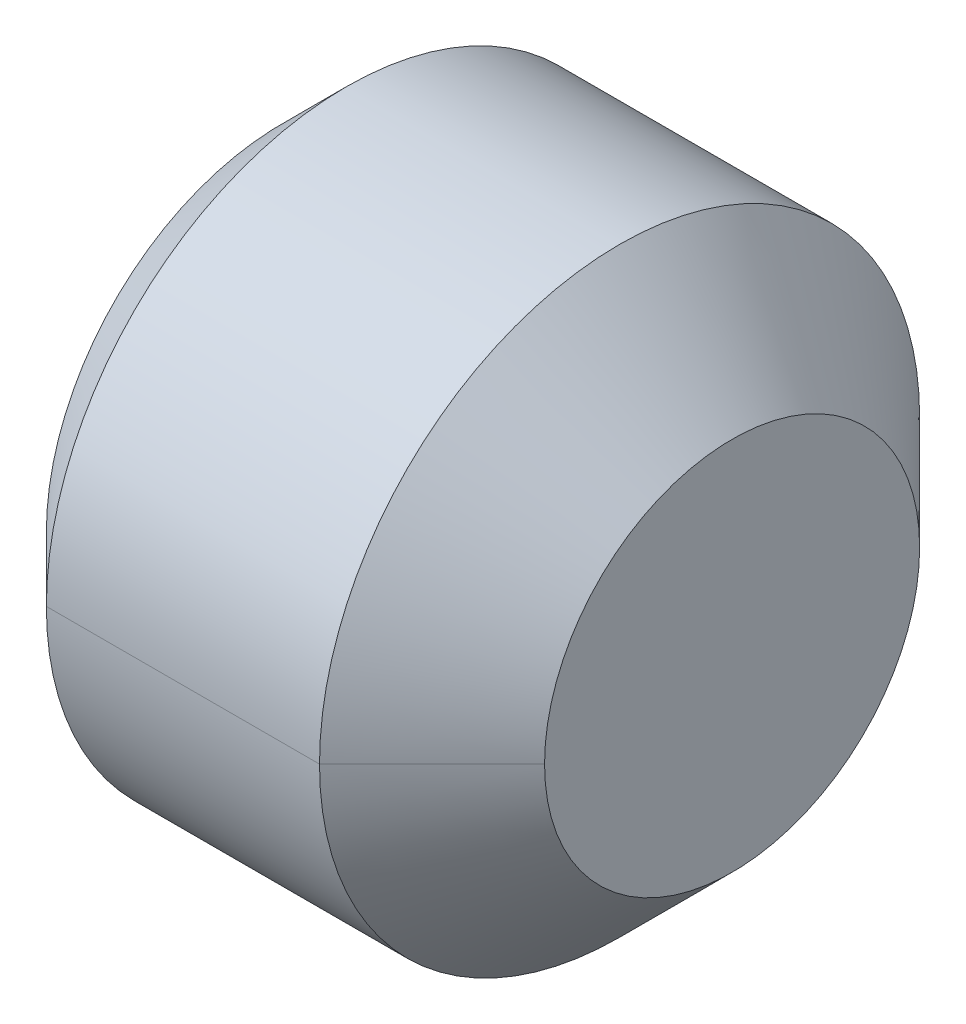
ISO-10303-21;
HEADER;
FILE_DESCRIPTION(('STEP AP214'),'2;1');
FILE_NAME('part.step','',(''),(''),'','','');
FILE_SCHEMA(('AUTOMOTIVE_DESIGN { 1 0 10303 214 1 1 1 1 }'));
ENDSEC;
DATA;
#1=APPLICATION_CONTEXT('core data for automotive mechanical design processes');
#2=APPLICATION_PROTOCOL_DEFINITION('international standard','automotive_design',2000,#1);
#3=PRODUCT_CONTEXT('',#1,'mechanical');
#4=PRODUCT('Part','Part','',(#3));
#5=PRODUCT_RELATED_PRODUCT_CATEGORY('part','',(#4));
#6=PRODUCT_DEFINITION_FORMATION('','',#4);
#7=PRODUCT_DEFINITION_CONTEXT('part definition',#1,'design');
#8=PRODUCT_DEFINITION('design','',#6,#7);
#9=PRODUCT_DEFINITION_SHAPE('','',#8);
#10=(LENGTH_UNIT() NAMED_UNIT(*) SI_UNIT(.MILLI.,.METRE.));
#11=(NAMED_UNIT(*) PLANE_ANGLE_UNIT() SI_UNIT($,.RADIAN.));
#12=(NAMED_UNIT(*) SI_UNIT($,.STERADIAN.) SOLID_ANGLE_UNIT());
#13=UNCERTAINTY_MEASURE_WITH_UNIT(LENGTH_MEASURE(1.E-05),#10,'distance_accuracy_value','');
#14=(GEOMETRIC_REPRESENTATION_CONTEXT(3) GLOBAL_UNCERTAINTY_ASSIGNED_CONTEXT((#13)) GLOBAL_UNIT_ASSIGNED_CONTEXT((#10,
#11,#12)) REPRESENTATION_CONTEXT('',''));
#15=CARTESIAN_POINT('',(0.,0.,0.));
#16=DIRECTION('',(0.,0.,1.));
#17=DIRECTION('',(1.,0.,0.));
#18=AXIS2_PLACEMENT_3D('',#15,#16,#17);
#19=CARTESIAN_POINT('',(-1.5,0.,0.));
#20=DIRECTION('',(-1.,0.,0.));
#21=DIRECTION('',(0.,0.,1.));
#22=AXIS2_PLACEMENT_3D('',#19,#20,#21);
#23=PLANE('',#22);
#24=DIRECTION('',(0.,0.866025403784422,0.500000000000029));
#25=VECTOR('',#24,1.);
#26=CARTESIAN_POINT('',(-1.5,-1.,0.57735026918963));
#27=LINE('',#26,#25);
#28=CARTESIAN_POINT('',(-1.5,-1.,0.57735026918963));
#29=VERTEX_POINT('',#28);
#30=CARTESIAN_POINT('',(-1.5,-0.50000000000004,0.866025403784442));
#31=VERTEX_POINT('',#30);
#32=EDGE_CURVE('E11',#29,#31,#27,.T.);
#33=ORIENTED_EDGE('',*,*,#32,.T.);
#34=CARTESIAN_POINT('',(-1.5,0.,0.));
#35=DIRECTION('',(1.,0.,0.));
#36=DIRECTION('',(0.,0.,1.));
#37=AXIS2_PLACEMENT_3D('',#34,#35,#36);
#38=CIRCLE('',#37,1.);
#39=CARTESIAN_POINT('',(-1.5,-1.,0.));
#40=VERTEX_POINT('',#39);
#41=EDGE_CURVE('E24',#31,#40,#38,.T.);
#42=ORIENTED_EDGE('',*,*,#41,.T.);
#43=DIRECTION('',(0.,0.,1.));
#44=VECTOR('',#43,1.);
#45=CARTESIAN_POINT('',(-1.5,-1.,-0.57735026918963));
#46=LINE('',#45,#44);
#47=EDGE_CURVE('E333',#40,#29,#46,.T.);
#48=ORIENTED_EDGE('',*,*,#47,.T.);
#49=EDGE_LOOP('',(#33,#42,#48));
#50=FACE_BOUND('',#49,.T.);
#51=ADVANCED_FACE('F16',(#50),#23,.T.);
#52=CARTESIAN_POINT('',(-1.5,-1.,-0.57735026918963));
#53=DIRECTION('',(0.,-1.,0.));
#54=DIRECTION('',(0.,0.,-1.));
#55=AXIS2_PLACEMENT_3D('',#52,#53,#54);
#56=PLANE('',#55);
#57=DIRECTION('',(0.,0.,1.));
#58=VECTOR('',#57,1.);
#59=CARTESIAN_POINT('',(-3.,-1.,-0.57735026918963));
#60=LINE('',#59,#58);
#61=CARTESIAN_POINT('',(-3.,-1.,-0.57735026918963));
#62=VERTEX_POINT('',#61);
#63=CARTESIAN_POINT('',(-3.,-1.,0.57735026918963));
#64=VERTEX_POINT('',#63);
#65=EDGE_CURVE('E329',#62,#64,#60,.T.);
#66=ORIENTED_EDGE('',*,*,#65,.T.);
#67=DIRECTION('',(-1.,0.,0.));
#68=VECTOR('',#67,1.);
#69=CARTESIAN_POINT('',(-1.5,-1.,0.57735026918963));
#70=LINE('',#69,#68);
#71=EDGE_CURVE('E324',#29,#64,#70,.T.);
#72=ORIENTED_EDGE('',*,*,#71,.F.);
#73=ORIENTED_EDGE('',*,*,#47,.F.);
#74=DIRECTION('',(0.,0.,1.));
#75=VECTOR('',#74,1.);
#76=CARTESIAN_POINT('',(-1.5,-1.,-0.57735026918963));
#77=LINE('',#76,#75);
#78=CARTESIAN_POINT('',(-1.5,-1.,-0.57735026918963));
#79=VERTEX_POINT('',#78);
#80=EDGE_CURVE('E319',#79,#40,#77,.T.);
#81=ORIENTED_EDGE('',*,*,#80,.F.);
#82=DIRECTION('',(-1.,0.,0.));
#83=VECTOR('',#82,1.);
#84=CARTESIAN_POINT('',(-1.5,-1.,-0.57735026918963));
#85=LINE('',#84,#83);
#86=EDGE_CURVE('E315',#79,#62,#85,.T.);
#87=ORIENTED_EDGE('',*,*,#86,.T.);
#88=EDGE_LOOP('',(#66,#72,#73,#81,#87));
#89=FACE_BOUND('',#88,.T.);
#90=ADVANCED_FACE('F344',(#89),#56,.F.);
#91=CARTESIAN_POINT('',(-1.5,0.,-1.1547005383793));
#92=DIRECTION('',(0.,-0.500000000000029,-0.866025403784422));
#93=DIRECTION('',(0.,0.866025403784422,-0.500000000000029));
#94=AXIS2_PLACEMENT_3D('',#91,#92,#93);
#95=PLANE('',#94);
#96=DIRECTION('',(0.,-0.866025403784422,0.500000000000029));
#97=VECTOR('',#96,1.);
#98=CARTESIAN_POINT('',(-3.,0.,-1.1547005383793));
#99=LINE('',#98,#97);
#100=CARTESIAN_POINT('',(-3.,0.,-1.1547005383793));
#101=VERTEX_POINT('',#100);
#102=EDGE_CURVE('E310',#101,#62,#99,.T.);
#103=ORIENTED_EDGE('',*,*,#102,.T.);
#104=ORIENTED_EDGE('',*,*,#86,.F.);
#105=DIRECTION('',(0.,-0.866025403784422,0.500000000000029));
#106=VECTOR('',#105,1.);
#107=CARTESIAN_POINT('',(-1.5,0.,-1.1547005383793));
#108=LINE('',#107,#106);
#109=CARTESIAN_POINT('',(-1.5,-0.500000000000029,-0.866025403784422));
#110=VERTEX_POINT('',#109);
#111=EDGE_CURVE('E305',#110,#79,#108,.T.);
#112=ORIENTED_EDGE('',*,*,#111,.F.);
#113=DIRECTION('',(0.,-0.866025403784422,0.500000000000029));
#114=VECTOR('',#113,1.);
#115=CARTESIAN_POINT('',(-1.5,0.,-1.1547005383793));
#116=LINE('',#115,#114);
#117=CARTESIAN_POINT('',(-1.5,0.,-1.1547005383793));
#118=VERTEX_POINT('',#117);
#119=EDGE_CURVE('E300',#118,#110,#116,.T.);
#120=ORIENTED_EDGE('',*,*,#119,.F.);
#121=DIRECTION('',(-1.,0.,0.));
#122=VECTOR('',#121,1.);
#123=CARTESIAN_POINT('',(-1.5,0.,-1.1547005383793));
#124=LINE('',#123,#122);
#125=EDGE_CURVE('E296',#118,#101,#124,.T.);
#126=ORIENTED_EDGE('',*,*,#125,.T.);
#127=EDGE_LOOP('',(#103,#104,#112,#120,#126));
#128=FACE_BOUND('',#127,.T.);
#129=ADVANCED_FACE('F362',(#128),#95,.F.);
#130=CARTESIAN_POINT('',(-1.5,1.,-0.57735026918963));
#131=DIRECTION('',(0.,0.500000000000029,-0.866025403784422));
#132=DIRECTION('',(0.,0.866025403784422,0.500000000000029));
#133=AXIS2_PLACEMENT_3D('',#130,#131,#132);
#134=PLANE('',#133);
#135=DIRECTION('',(0.,-0.866025403784422,-0.500000000000029));
#136=VECTOR('',#135,1.);
#137=CARTESIAN_POINT('',(-3.,1.,-0.57735026918963));
#138=LINE('',#137,#136);
#139=CARTESIAN_POINT('',(-3.,1.,-0.57735026918963));
#140=VERTEX_POINT('',#139);
#141=EDGE_CURVE('E291',#140,#101,#138,.T.);
#142=ORIENTED_EDGE('',*,*,#141,.T.);
#143=ORIENTED_EDGE('',*,*,#125,.F.);
#144=DIRECTION('',(0.,-0.866025403784422,-0.500000000000029));
#145=VECTOR('',#144,1.);
#146=CARTESIAN_POINT('',(-1.5,1.,-0.57735026918963));
#147=LINE('',#146,#145);
#148=CARTESIAN_POINT('',(-1.5,0.500000000000029,-0.866025403784422));
#149=VERTEX_POINT('',#148);
#150=EDGE_CURVE('E286',#149,#118,#147,.T.);
#151=ORIENTED_EDGE('',*,*,#150,.F.);
#152=DIRECTION('',(0.,-0.866025403784422,-0.500000000000029));
#153=VECTOR('',#152,1.);
#154=CARTESIAN_POINT('',(-1.5,1.,-0.57735026918963));
#155=LINE('',#154,#153);
#156=CARTESIAN_POINT('',(-1.5,1.,-0.57735026918963));
#157=VERTEX_POINT('',#156);
#158=EDGE_CURVE('E281',#157,#149,#155,.T.);
#159=ORIENTED_EDGE('',*,*,#158,.F.);
#160=DIRECTION('',(-1.,0.,0.));
#161=VECTOR('',#160,1.);
#162=CARTESIAN_POINT('',(-1.5,1.,-0.57735026918963));
#163=LINE('',#162,#161);
#164=EDGE_CURVE('E277',#157,#140,#163,.T.);
#165=ORIENTED_EDGE('',*,*,#164,.T.);
#166=EDGE_LOOP('',(#142,#143,#151,#159,#165));
#167=FACE_BOUND('',#166,.T.);
#168=ADVANCED_FACE('F382',(#167),#134,.F.);
#169=CARTESIAN_POINT('',(-1.5,1.,0.57735026918963));
#170=DIRECTION('',(0.,1.,0.));
#171=DIRECTION('',(0.,0.,1.));
#172=AXIS2_PLACEMENT_3D('',#169,#170,#171);
#173=PLANE('',#172);
#174=DIRECTION('',(-1.,0.,0.));
#175=VECTOR('',#174,1.);
#176=CARTESIAN_POINT('',(-1.5,1.,0.57735026918963));
#177=LINE('',#176,#175);
#178=CARTESIAN_POINT('',(-1.5,1.,0.57735026918963));
#179=VERTEX_POINT('',#178);
#180=CARTESIAN_POINT('',(-3.,1.,0.57735026918963));
#181=VERTEX_POINT('',#180);
#182=EDGE_CURVE('E273',#179,#181,#177,.T.);
#183=ORIENTED_EDGE('',*,*,#182,.T.);
#184=DIRECTION('',(0.,0.,1.));
#185=VECTOR('',#184,1.);
#186=CARTESIAN_POINT('',(-3.,1.,0.));
#187=LINE('',#186,#185);
#188=EDGE_CURVE('E268',#140,#181,#187,.T.);
#189=ORIENTED_EDGE('',*,*,#188,.F.);
#190=ORIENTED_EDGE('',*,*,#164,.F.);
#191=DIRECTION('',(0.,0.,-1.));
#192=VECTOR('',#191,1.);
#193=CARTESIAN_POINT('',(-1.5,1.,0.57735026918963));
#194=LINE('',#193,#192);
#195=CARTESIAN_POINT('',(-1.5,1.,0.));
#196=VERTEX_POINT('',#195);
#197=EDGE_CURVE('E263',#196,#157,#194,.T.);
#198=ORIENTED_EDGE('',*,*,#197,.F.);
#199=DIRECTION('',(0.,0.,-1.));
#200=VECTOR('',#199,1.);
#201=CARTESIAN_POINT('',(-1.5,1.,0.57735026918963));
#202=LINE('',#201,#200);
#203=EDGE_CURVE('E258',#179,#196,#202,.T.);
#204=ORIENTED_EDGE('',*,*,#203,.F.);
#205=EDGE_LOOP('',(#183,#189,#190,#198,#204));
#206=FACE_BOUND('',#205,.T.);
#207=ADVANCED_FACE('F385',(#206),#173,.F.);
#208=CARTESIAN_POINT('',(-1.5,0.,0.));
#209=DIRECTION('',(-1.,0.,0.));
#210=DIRECTION('',(0.,0.,1.));
#211=AXIS2_PLACEMENT_3D('',#208,#209,#210);
#212=PLANE('',#211);
#213=ORIENTED_EDGE('',*,*,#203,.T.);
#214=CARTESIAN_POINT('',(-1.5,0.,0.));
#215=DIRECTION('',(1.,0.,0.));
#216=DIRECTION('',(0.,0.,-1.));
#217=AXIS2_PLACEMENT_3D('',#214,#215,#216);
#218=CIRCLE('',#217,1.);
#219=CARTESIAN_POINT('',(-1.5,0.500000000000029,0.866025403784422));
#220=VERTEX_POINT('',#219);
#221=EDGE_CURVE('E254',#196,#220,#218,.T.);
#222=ORIENTED_EDGE('',*,*,#221,.T.);
#223=DIRECTION('',(0.,0.866025403784422,-0.500000000000029));
#224=VECTOR('',#223,1.);
#225=CARTESIAN_POINT('',(-1.5,0.,1.1547005383793));
#226=LINE('',#225,#224);
#227=EDGE_CURVE('E249',#220,#179,#226,.T.);
#228=ORIENTED_EDGE('',*,*,#227,.T.);
#229=EDGE_LOOP('',(#213,#222,#228));
#230=FACE_BOUND('',#229,.T.);
#231=ADVANCED_FACE('F387',(#230),#212,.T.);
#232=CARTESIAN_POINT('',(-1.5,0.,1.1547005383793));
#233=DIRECTION('',(0.,0.500000000000029,0.866025403784422));
#234=DIRECTION('',(0.,-0.866025403784422,0.500000000000029));
#235=AXIS2_PLACEMENT_3D('',#232,#233,#234);
#236=PLANE('',#235);
#237=DIRECTION('',(0.,0.866025403784422,-0.500000000000029));
#238=VECTOR('',#237,1.);
#239=CARTESIAN_POINT('',(-3.,0.,1.1547005383793));
#240=LINE('',#239,#238);
#241=CARTESIAN_POINT('',(-3.,0.,1.1547005383793));
#242=VERTEX_POINT('',#241);
#243=EDGE_CURVE('E244',#242,#181,#240,.T.);
#244=ORIENTED_EDGE('',*,*,#243,.T.);
#245=ORIENTED_EDGE('',*,*,#182,.F.);
#246=ORIENTED_EDGE('',*,*,#227,.F.);
#247=DIRECTION('',(0.,0.866025403784422,-0.500000000000029));
#248=VECTOR('',#247,1.);
#249=CARTESIAN_POINT('',(-1.5,0.,1.1547005383793));
#250=LINE('',#249,#248);
#251=CARTESIAN_POINT('',(-1.5,0.,1.1547005383793));
#252=VERTEX_POINT('',#251);
#253=EDGE_CURVE('E239',#252,#220,#250,.T.);
#254=ORIENTED_EDGE('',*,*,#253,.F.);
#255=DIRECTION('',(-1.,0.,0.));
#256=VECTOR('',#255,1.);
#257=CARTESIAN_POINT('',(-1.5,0.,1.1547005383793));
#258=LINE('',#257,#256);
#259=EDGE_CURVE('E235',#252,#242,#258,.T.);
#260=ORIENTED_EDGE('',*,*,#259,.T.);
#261=EDGE_LOOP('',(#244,#245,#246,#254,#260));
#262=FACE_BOUND('',#261,.T.);
#263=ADVANCED_FACE('F371',(#262),#236,.F.);
#264=CARTESIAN_POINT('',(-1.5,-1.,0.57735026918963));
#265=DIRECTION('',(0.,-0.500000000000029,0.866025403784422));
#266=DIRECTION('',(0.,-0.866025403784422,-0.500000000000029));
#267=AXIS2_PLACEMENT_3D('',#264,#265,#266);
#268=PLANE('',#267);
#269=DIRECTION('',(0.,0.866025403784422,0.500000000000029));
#270=VECTOR('',#269,1.);
#271=CARTESIAN_POINT('',(-3.,-1.,0.57735026918963));
#272=LINE('',#271,#270);
#273=EDGE_CURVE('E230',#64,#242,#272,.T.);
#274=ORIENTED_EDGE('',*,*,#273,.T.);
#275=ORIENTED_EDGE('',*,*,#259,.F.);
#276=DIRECTION('',(0.,0.866025403784422,0.500000000000029));
#277=VECTOR('',#276,1.);
#278=CARTESIAN_POINT('',(-1.5,-1.,0.57735026918963));
#279=LINE('',#278,#277);
#280=EDGE_CURVE('E225',#31,#252,#279,.T.);
#281=ORIENTED_EDGE('',*,*,#280,.F.);
#282=ORIENTED_EDGE('',*,*,#32,.F.);
#283=ORIENTED_EDGE('',*,*,#71,.T.);
#284=EDGE_LOOP('',(#274,#275,#281,#282,#283));
#285=FACE_BOUND('',#284,.T.);
#286=ADVANCED_FACE('F348',(#285),#268,.F.);
#287=CARTESIAN_POINT('',(-1.5,0.,0.));
#288=DIRECTION('',(-1.,0.,0.));
#289=DIRECTION('',(0.,0.,1.));
#290=AXIS2_PLACEMENT_3D('',#287,#288,#289);
#291=PLANE('',#290);
#292=ORIENTED_EDGE('',*,*,#253,.T.);
#293=CARTESIAN_POINT('',(-1.5,0.,0.));
#294=DIRECTION('',(1.,0.,0.));
#295=DIRECTION('',(0.,0.,1.));
#296=AXIS2_PLACEMENT_3D('',#293,#294,#295);
#297=CIRCLE('',#296,1.);
#298=CARTESIAN_POINT('',(-1.5,0.,1.));
#299=VERTEX_POINT('',#298);
#300=EDGE_CURVE('E221',#220,#299,#297,.T.);
#301=ORIENTED_EDGE('',*,*,#300,.T.);
#302=CARTESIAN_POINT('',(-1.5,0.,0.));
#303=DIRECTION('',(1.,0.,0.));
#304=DIRECTION('',(0.,0.,1.));
#305=AXIS2_PLACEMENT_3D('',#302,#303,#304);
#306=CIRCLE('',#305,1.);
#307=EDGE_CURVE('E216',#299,#31,#306,.T.);
#308=ORIENTED_EDGE('',*,*,#307,.T.);
#309=ORIENTED_EDGE('',*,*,#280,.T.);
#310=EDGE_LOOP('',(#292,#301,#308,#309));
#311=FACE_BOUND('',#310,.T.);
#312=ADVANCED_FACE('F352',(#311),#291,.T.);
#313=CARTESIAN_POINT('',(-1.5,0.,0.));
#314=DIRECTION('',(-1.,0.,0.));
#315=DIRECTION('',(0.,1.,0.));
#316=AXIS2_PLACEMENT_3D('',#313,#314,#315);
#317=CONICAL_SURFACE('',#316,1.,1.0471975511966);
#318=DIRECTION('',(-0.500000000000001,0.,-0.866025403784438));
#319=VECTOR('',#318,1.);
#320=CARTESIAN_POINT('',(-0.922649730810373,0.,0.));
#321=LINE('',#320,#319);
#322=CARTESIAN_POINT('',(-0.922649730810373,0.,0.));
#323=VERTEX_POINT('',#322);
#324=CARTESIAN_POINT('',(-1.5,0.,-1.));
#325=VERTEX_POINT('',#324);
#326=EDGE_CURVE('E212',#323,#325,#321,.T.);
#327=ORIENTED_EDGE('',*,*,#326,.T.);
#328=CARTESIAN_POINT('',(-1.5,0.,0.));
#329=DIRECTION('',(1.,0.,0.));
#330=DIRECTION('',(0.,0.,1.));
#331=AXIS2_PLACEMENT_3D('',#328,#329,#330);
#332=CIRCLE('',#331,1.);
#333=EDGE_CURVE('E207',#110,#325,#332,.T.);
#334=ORIENTED_EDGE('',*,*,#333,.F.);
#335=CARTESIAN_POINT('',(-1.5,0.,0.));
#336=DIRECTION('',(1.,0.,0.));
#337=DIRECTION('',(0.,0.,1.));
#338=AXIS2_PLACEMENT_3D('',#335,#336,#337);
#339=CIRCLE('',#338,1.);
#340=EDGE_CURVE('E202',#40,#110,#339,.T.);
#341=ORIENTED_EDGE('',*,*,#340,.F.);
#342=ORIENTED_EDGE('',*,*,#41,.F.);
#343=ORIENTED_EDGE('',*,*,#307,.F.);
#344=DIRECTION('',(-0.500000000000001,0.,0.866025403784438));
#345=VECTOR('',#344,1.);
#346=CARTESIAN_POINT('',(-0.922649730810373,0.,0.));
#347=LINE('',#346,#345);
#348=EDGE_CURVE('E197',#323,#299,#347,.T.);
#349=ORIENTED_EDGE('',*,*,#348,.F.);
#350=EDGE_LOOP('',(#327,#334,#341,#342,#343,#349));
#351=FACE_BOUND('',#350,.T.);
#352=ADVANCED_FACE('F355',(#351),#317,.F.);
#353=CARTESIAN_POINT('',(-1.5,0.,0.));
#354=DIRECTION('',(-1.,0.,0.));
#355=DIRECTION('',(0.,-1.,0.));
#356=AXIS2_PLACEMENT_3D('',#353,#354,#355);
#357=CONICAL_SURFACE('',#356,1.,1.0471975511966);
#358=ORIENTED_EDGE('',*,*,#348,.T.);
#359=ORIENTED_EDGE('',*,*,#300,.F.);
#360=ORIENTED_EDGE('',*,*,#221,.F.);
#361=CARTESIAN_POINT('',(-1.5,0.,0.));
#362=DIRECTION('',(1.,0.,0.));
#363=DIRECTION('',(0.,0.,1.));
#364=AXIS2_PLACEMENT_3D('',#361,#362,#363);
#365=CIRCLE('',#364,1.);
#366=EDGE_CURVE('E192',#149,#196,#365,.T.);
#367=ORIENTED_EDGE('',*,*,#366,.F.);
#368=CARTESIAN_POINT('',(-1.5,0.,0.));
#369=DIRECTION('',(1.,0.,0.));
#370=DIRECTION('',(0.,0.,1.));
#371=AXIS2_PLACEMENT_3D('',#368,#369,#370);
#372=CIRCLE('',#371,1.);
#373=EDGE_CURVE('E187',#325,#149,#372,.T.);
#374=ORIENTED_EDGE('',*,*,#373,.F.);
#375=ORIENTED_EDGE('',*,*,#326,.F.);
#376=EDGE_LOOP('',(#358,#359,#360,#367,#374,#375));
#377=FACE_BOUND('',#376,.T.);
#378=ADVANCED_FACE('F375',(#377),#357,.F.);
#379=CARTESIAN_POINT('',(-1.5,0.,0.));
#380=DIRECTION('',(-1.,0.,0.));
#381=DIRECTION('',(0.,0.,1.));
#382=AXIS2_PLACEMENT_3D('',#379,#380,#381);
#383=PLANE('',#382);
#384=ORIENTED_EDGE('',*,*,#119,.T.);
#385=ORIENTED_EDGE('',*,*,#333,.T.);
#386=ORIENTED_EDGE('',*,*,#373,.T.);
#387=ORIENTED_EDGE('',*,*,#150,.T.);
#388=EDGE_LOOP('',(#384,#385,#386,#387));
#389=FACE_BOUND('',#388,.T.);
#390=ADVANCED_FACE('F380',(#389),#383,.T.);
#391=CARTESIAN_POINT('',(-1.5,0.,0.));
#392=DIRECTION('',(-1.,0.,0.));
#393=DIRECTION('',(0.,0.,1.));
#394=AXIS2_PLACEMENT_3D('',#391,#392,#393);
#395=PLANE('',#394);
#396=ORIENTED_EDGE('',*,*,#158,.T.);
#397=ORIENTED_EDGE('',*,*,#366,.T.);
#398=ORIENTED_EDGE('',*,*,#197,.T.);
#399=EDGE_LOOP('',(#396,#397,#398));
#400=FACE_BOUND('',#399,.T.);
#401=ADVANCED_FACE('F479',(#400),#395,.T.);
#402=CARTESIAN_POINT('',(-1.5,0.,0.));
#403=DIRECTION('',(-1.,0.,0.));
#404=DIRECTION('',(0.,0.,1.));
#405=AXIS2_PLACEMENT_3D('',#402,#403,#404);
#406=PLANE('',#405);
#407=ORIENTED_EDGE('',*,*,#80,.T.);
#408=ORIENTED_EDGE('',*,*,#340,.T.);
#409=ORIENTED_EDGE('',*,*,#111,.T.);
#410=EDGE_LOOP('',(#407,#408,#409));
#411=FACE_BOUND('',#410,.T.);
#412=ADVANCED_FACE('F358',(#411),#406,.T.);
#413=CARTESIAN_POINT('',(-3.,0.,0.));
#414=DIRECTION('',(1.,0.,0.));
#415=DIRECTION('',(0.,0.,-1.));
#416=AXIS2_PLACEMENT_3D('',#413,#414,#415);
#417=PLANE('',#416);
#418=CARTESIAN_POINT('',(-3.,0.,0.));
#419=DIRECTION('',(1.,0.,0.));
#420=DIRECTION('',(0.,0.,-1.));
#421=AXIS2_PLACEMENT_3D('',#418,#419,#420);
#422=CIRCLE('',#421,1.5705);
#423=CARTESIAN_POINT('',(-3.,0.,1.5705));
#424=VERTEX_POINT('',#423);
#425=CARTESIAN_POINT('',(-3.,0.,-1.5705));
#426=VERTEX_POINT('',#425);
#427=EDGE_CURVE('E182',#424,#426,#422,.T.);
#428=ORIENTED_EDGE('',*,*,#427,.F.);
#429=CARTESIAN_POINT('',(-3.,0.,0.));
#430=DIRECTION('',(1.,0.,0.));
#431=DIRECTION('',(0.,0.,-1.));
#432=AXIS2_PLACEMENT_3D('',#429,#430,#431);
#433=CIRCLE('',#432,1.5705);
#434=EDGE_CURVE('E177',#426,#424,#433,.T.);
#435=ORIENTED_EDGE('',*,*,#434,.F.);
#436=EDGE_LOOP('',(#428,#435));
#437=FACE_BOUND('',#436,.T.);
#438=ORIENTED_EDGE('',*,*,#243,.F.);
#439=ORIENTED_EDGE('',*,*,#273,.F.);
#440=ORIENTED_EDGE('',*,*,#65,.F.);
#441=ORIENTED_EDGE('',*,*,#102,.F.);
#442=ORIENTED_EDGE('',*,*,#141,.F.);
#443=ORIENTED_EDGE('',*,*,#188,.T.);
#444=EDGE_LOOP('',(#438,#439,#440,#441,#442,#443));
#445=FACE_BOUND('',#444,.T.);
#446=ADVANCED_FACE('F367',(#437,#445),#417,.F.);
#447=CARTESIAN_POINT('',(-3.,0.,0.));
#448=DIRECTION('',(1.,0.,0.));
#449=DIRECTION('',(0.,-1.,0.));
#450=AXIS2_PLACEMENT_3D('',#447,#448,#449);
#451=CONICAL_SURFACE('',#450,1.5705,0.785398163397448);
#452=DIRECTION('',(0.707106781186548,0.,0.707106781186548));
#453=VECTOR('',#452,1.);
#454=CARTESIAN_POINT('',(-3.,0.,1.5705));
#455=LINE('',#454,#453);
#456=CARTESIAN_POINT('',(-2.5705,0.,2.));
#457=VERTEX_POINT('',#456);
#458=EDGE_CURVE('E173',#424,#457,#455,.T.);
#459=ORIENTED_EDGE('',*,*,#458,.T.);
#460=CARTESIAN_POINT('',(-2.5705,0.,0.));
#461=DIRECTION('',(1.,0.,0.));
#462=DIRECTION('',(0.,0.,-1.));
#463=AXIS2_PLACEMENT_3D('',#460,#461,#462);
#464=CIRCLE('',#463,2.);
#465=CARTESIAN_POINT('',(-2.5705,0.,-2.));
#466=VERTEX_POINT('',#465);
#467=EDGE_CURVE('E168',#466,#457,#464,.T.);
#468=ORIENTED_EDGE('',*,*,#467,.F.);
#469=DIRECTION('',(0.707106781186548,0.,-0.707106781186548));
#470=VECTOR('',#469,1.);
#471=CARTESIAN_POINT('',(-3.,0.,-1.5705));
#472=LINE('',#471,#470);
#473=EDGE_CURVE('E163',#426,#466,#472,.T.);
#474=ORIENTED_EDGE('',*,*,#473,.F.);
#475=ORIENTED_EDGE('',*,*,#434,.T.);
#476=EDGE_LOOP('',(#459,#468,#474,#475));
#477=FACE_BOUND('',#476,.T.);
#478=ADVANCED_FACE('F508',(#477),#451,.T.);
#479=CARTESIAN_POINT('',(-3.,0.,0.));
#480=DIRECTION('',(1.,0.,0.));
#481=DIRECTION('',(0.,1.,0.));
#482=AXIS2_PLACEMENT_3D('',#479,#480,#481);
#483=CONICAL_SURFACE('',#482,1.5705,0.785398163397448);
#484=ORIENTED_EDGE('',*,*,#458,.F.);
#485=ORIENTED_EDGE('',*,*,#427,.T.);
#486=ORIENTED_EDGE('',*,*,#473,.T.);
#487=CARTESIAN_POINT('',(-2.5705,0.,0.));
#488=DIRECTION('',(1.,0.,0.));
#489=DIRECTION('',(0.,0.,-1.));
#490=AXIS2_PLACEMENT_3D('',#487,#488,#489);
#491=CIRCLE('',#490,2.);
#492=EDGE_CURVE('E158',#457,#466,#491,.T.);
#493=ORIENTED_EDGE('',*,*,#492,.F.);
#494=EDGE_LOOP('',(#484,#485,#486,#493));
#495=FACE_BOUND('',#494,.T.);
#496=ADVANCED_FACE('F519',(#495),#483,.T.);
#497=CARTESIAN_POINT('',(0.,0.,0.));
#498=DIRECTION('',(1.,0.,0.));
#499=DIRECTION('',(0.,1.,0.));
#500=AXIS2_PLACEMENT_3D('',#497,#498,#499);
#501=CYLINDRICAL_SURFACE('',#500,2.);
#502=DIRECTION('',(1.,0.,0.));
#503=VECTOR('',#502,1.);
#504=CARTESIAN_POINT('',(-2.5705,0.,2.));
#505=LINE('',#504,#503);
#506=CARTESIAN_POINT('',(-0.75,0.,2.));
#507=VERTEX_POINT('',#506);
#508=EDGE_CURVE('E153',#457,#507,#505,.T.);
#509=ORIENTED_EDGE('',*,*,#508,.F.);
#510=ORIENTED_EDGE('',*,*,#492,.T.);
#511=DIRECTION('',(1.,0.,0.));
#512=VECTOR('',#511,1.);
#513=CARTESIAN_POINT('',(-2.5705,0.,-2.));
#514=LINE('',#513,#512);
#515=CARTESIAN_POINT('',(-0.75,0.,-2.));
#516=VERTEX_POINT('',#515);
#517=EDGE_CURVE('E149',#466,#516,#514,.T.);
#518=ORIENTED_EDGE('',*,*,#517,.T.);
#519=CARTESIAN_POINT('',(-0.75,0.,0.));
#520=DIRECTION('',(1.,0.,0.));
#521=DIRECTION('',(0.,0.,-1.));
#522=AXIS2_PLACEMENT_3D('',#519,#520,#521);
#523=CIRCLE('',#522,2.);
#524=EDGE_CURVE('E145',#507,#516,#523,.T.);
#525=ORIENTED_EDGE('',*,*,#524,.F.);
#526=EDGE_LOOP('',(#509,#510,#518,#525));
#527=FACE_BOUND('',#526,.T.);
#528=ADVANCED_FACE('F530',(#527),#501,.T.);
#529=CARTESIAN_POINT('',(-0.75,0.,0.));
#530=DIRECTION('',(-1.,0.,0.));
#531=DIRECTION('',(0.,1.,0.));
#532=AXIS2_PLACEMENT_3D('',#529,#530,#531);
#533=CONICAL_SURFACE('',#532,2.,0.785398163397448);
#534=DIRECTION('',(-0.707106781186548,0.,-0.707106781186547));
#535=VECTOR('',#534,1.);
#536=CARTESIAN_POINT('',(0.,0.,-1.25));
#537=LINE('',#536,#535);
#538=CARTESIAN_POINT('',(0.,0.,-1.25));
#539=VERTEX_POINT('',#538);
#540=EDGE_CURVE('E123',#539,#516,#537,.T.);
#541=ORIENTED_EDGE('',*,*,#540,.F.);
#542=CARTESIAN_POINT('',(0.,0.,0.));
#543=DIRECTION('',(1.,0.,0.));
#544=DIRECTION('',(0.,0.,-1.));
#545=AXIS2_PLACEMENT_3D('',#542,#543,#544);
#546=CIRCLE('',#545,1.25);
#547=CARTESIAN_POINT('',(0.,0.,1.25));
#548=VERTEX_POINT('',#547);
#549=EDGE_CURVE('E116',#548,#539,#546,.T.);
#550=ORIENTED_EDGE('',*,*,#549,.F.);
#551=DIRECTION('',(-0.707106781186548,0.,0.707106781186547));
#552=VECTOR('',#551,1.);
#553=CARTESIAN_POINT('',(0.,0.,1.25));
#554=LINE('',#553,#552);
#555=EDGE_CURVE('E121',#548,#507,#554,.T.);
#556=ORIENTED_EDGE('',*,*,#555,.T.);
#557=ORIENTED_EDGE('',*,*,#524,.T.);
#558=EDGE_LOOP('',(#541,#550,#556,#557));
#559=FACE_BOUND('',#558,.T.);
#560=ADVANCED_FACE('F118',(#559),#533,.T.);
#561=CARTESIAN_POINT('',(-0.75,0.,0.));
#562=DIRECTION('',(-1.,0.,0.));
#563=DIRECTION('',(0.,-1.,0.));
#564=AXIS2_PLACEMENT_3D('',#561,#562,#563);
#565=CONICAL_SURFACE('',#564,2.,0.785398163397448);
#566=ORIENTED_EDGE('',*,*,#540,.T.);
#567=CARTESIAN_POINT('',(-0.75,0.,0.));
#568=DIRECTION('',(1.,0.,0.));
#569=DIRECTION('',(0.,0.,-1.));
#570=AXIS2_PLACEMENT_3D('',#567,#568,#569);
#571=CIRCLE('',#570,2.);
#572=EDGE_CURVE('E130',#516,#507,#571,.T.);
#573=ORIENTED_EDGE('',*,*,#572,.T.);
#574=ORIENTED_EDGE('',*,*,#555,.F.);
#575=CARTESIAN_POINT('',(0.,0.,0.));
#576=DIRECTION('',(1.,0.,0.));
#577=DIRECTION('',(0.,0.,-1.));
#578=AXIS2_PLACEMENT_3D('',#575,#576,#577);
#579=CIRCLE('',#578,1.25);
#580=EDGE_CURVE('E127',#539,#548,#579,.T.);
#581=ORIENTED_EDGE('',*,*,#580,.F.);
#582=EDGE_LOOP('',(#566,#573,#574,#581));
#583=FACE_BOUND('',#582,.T.);
#584=ADVANCED_FACE('F133',(#583),#565,.T.);
#585=CARTESIAN_POINT('',(0.,1.25,0.));
#586=DIRECTION('',(-1.,0.,0.));
#587=DIRECTION('',(0.,0.,1.));
#588=AXIS2_PLACEMENT_3D('',#585,#586,#587);
#589=PLANE('',#588);
#590=ORIENTED_EDGE('',*,*,#580,.T.);
#591=ORIENTED_EDGE('',*,*,#549,.T.);
#592=EDGE_LOOP('',(#590,#591));
#593=FACE_BOUND('',#592,.T.);
#594=ADVANCED_FACE('F128',(#593),#589,.F.);
#595=CARTESIAN_POINT('',(0.,0.,0.));
#596=DIRECTION('',(1.,0.,0.));
#597=DIRECTION('',(0.,-1.,0.));
#598=AXIS2_PLACEMENT_3D('',#595,#596,#597);
#599=CYLINDRICAL_SURFACE('',#598,2.);
#600=ORIENTED_EDGE('',*,*,#508,.T.);
#601=ORIENTED_EDGE('',*,*,#572,.F.);
#602=ORIENTED_EDGE('',*,*,#517,.F.);
#603=ORIENTED_EDGE('',*,*,#467,.T.);
#604=EDGE_LOOP('',(#600,#601,#602,#603));
#605=FACE_BOUND('',#604,.T.);
#606=ADVANCED_FACE('F569',(#605),#599,.T.);
#607=CLOSED_SHELL('',(#51,#90,#129,#168,#207,#231,#263,#286,#312,#352,#378,#390,#401,#412,#446,
#478,#496,#528,#560,#584,#594,#606));
#608=MANIFOLD_SOLID_BREP('B1',#607);
#609=ADVANCED_BREP_SHAPE_REPRESENTATION('',(#18,#608),#14);
#610=SHAPE_DEFINITION_REPRESENTATION(#9,#609);
ENDSEC;
END-ISO-10303-21;
